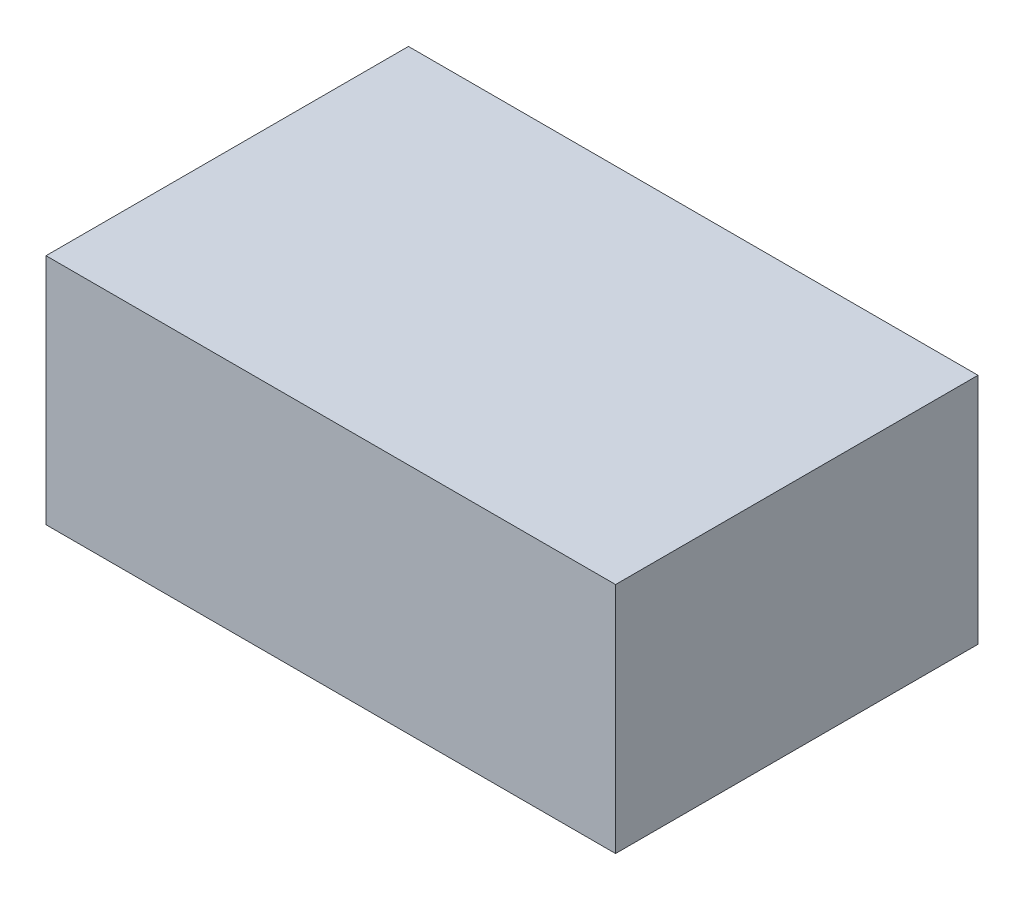
ISO-10303-21;
HEADER;
FILE_DESCRIPTION(('STEP AP214'),'2;1');
FILE_NAME('part.step','',(''),(''),'','','');
FILE_SCHEMA(('AUTOMOTIVE_DESIGN { 1 0 10303 214 1 1 1 1 }'));
ENDSEC;
DATA;
#1=APPLICATION_CONTEXT('core data for automotive mechanical design processes');
#2=APPLICATION_PROTOCOL_DEFINITION('international standard','automotive_design',2000,#1);
#3=PRODUCT_CONTEXT('',#1,'mechanical');
#4=PRODUCT('Part','Part','',(#3));
#5=PRODUCT_RELATED_PRODUCT_CATEGORY('part','',(#4));
#6=PRODUCT_DEFINITION_FORMATION('','',#4);
#7=PRODUCT_DEFINITION_CONTEXT('part definition',#1,'design');
#8=PRODUCT_DEFINITION('design','',#6,#7);
#9=PRODUCT_DEFINITION_SHAPE('','',#8);
#10=(LENGTH_UNIT() NAMED_UNIT(*) SI_UNIT(.MILLI.,.METRE.));
#11=(NAMED_UNIT(*) PLANE_ANGLE_UNIT() SI_UNIT($,.RADIAN.));
#12=(NAMED_UNIT(*) SI_UNIT($,.STERADIAN.) SOLID_ANGLE_UNIT());
#13=UNCERTAINTY_MEASURE_WITH_UNIT(LENGTH_MEASURE(1.E-05),#10,'distance_accuracy_value','');
#14=(GEOMETRIC_REPRESENTATION_CONTEXT(3) GLOBAL_UNCERTAINTY_ASSIGNED_CONTEXT((#13)) GLOBAL_UNIT_ASSIGNED_CONTEXT((#10,
#11,#12)) REPRESENTATION_CONTEXT('',''));
#15=CARTESIAN_POINT('',(0.,0.,0.));
#16=DIRECTION('',(0.,0.,1.));
#17=DIRECTION('',(1.,0.,0.));
#18=AXIS2_PLACEMENT_3D('',#15,#16,#17);
#19=CARTESIAN_POINT('',(34.925,28.575,22.225));
#20=DIRECTION('',(-1.,0.,0.));
#21=DIRECTION('',(0.,0.,1.));
#22=AXIS2_PLACEMENT_3D('',#19,#20,#21);
#23=PLANE('',#22);
#24=DIRECTION('',(0.,0.,-1.));
#25=VECTOR('',#24,1.);
#26=CARTESIAN_POINT('',(34.925,0.,22.225));
#27=LINE('',#26,#25);
#28=CARTESIAN_POINT('',(34.925,0.,22.225));
#29=VERTEX_POINT('',#28);
#30=CARTESIAN_POINT('',(34.925,0.,-22.225));
#31=VERTEX_POINT('',#30);
#32=EDGE_CURVE('E97',#29,#31,#27,.T.);
#33=ORIENTED_EDGE('',*,*,#32,.T.);
#34=DIRECTION('',(0.,-1.,0.));
#35=VECTOR('',#34,1.);
#36=CARTESIAN_POINT('',(34.925,28.575,-22.225));
#37=LINE('',#36,#35);
#38=CARTESIAN_POINT('',(34.925,28.575,-22.225));
#39=VERTEX_POINT('',#38);
#40=EDGE_CURVE('E11',#39,#31,#37,.T.);
#41=ORIENTED_EDGE('',*,*,#40,.F.);
#42=DIRECTION('',(0.,0.,-1.));
#43=VECTOR('',#42,1.);
#44=CARTESIAN_POINT('',(34.925,28.575,22.225));
#45=LINE('',#44,#43);
#46=CARTESIAN_POINT('',(34.925,28.575,22.225));
#47=VERTEX_POINT('',#46);
#48=EDGE_CURVE('E85',#47,#39,#45,.T.);
#49=ORIENTED_EDGE('',*,*,#48,.F.);
#50=DIRECTION('',(0.,-1.,0.));
#51=VECTOR('',#50,1.);
#52=CARTESIAN_POINT('',(34.925,28.575,22.225));
#53=LINE('',#52,#51);
#54=EDGE_CURVE('E93',#47,#29,#53,.T.);
#55=ORIENTED_EDGE('',*,*,#54,.T.);
#56=EDGE_LOOP('',(#33,#41,#49,#55));
#57=FACE_BOUND('',#56,.T.);
#58=ADVANCED_FACE('F34',(#57),#23,.F.);
#59=CARTESIAN_POINT('',(-34.925,28.575,-22.225));
#60=DIRECTION('',(0.,0.,1.));
#61=DIRECTION('',(1.,0.,0.));
#62=AXIS2_PLACEMENT_3D('',#59,#60,#61);
#63=PLANE('',#62);
#64=DIRECTION('',(-1.,0.,0.));
#65=VECTOR('',#64,1.);
#66=CARTESIAN_POINT('',(-34.925,0.,-22.225));
#67=LINE('',#66,#65);
#68=CARTESIAN_POINT('',(-34.925,0.,-22.225));
#69=VERTEX_POINT('',#68);
#70=EDGE_CURVE('E89',#31,#69,#67,.T.);
#71=ORIENTED_EDGE('',*,*,#70,.T.);
#72=DIRECTION('',(0.,-1.,0.));
#73=VECTOR('',#72,1.);
#74=CARTESIAN_POINT('',(-34.925,28.575,-22.225));
#75=LINE('',#74,#73);
#76=CARTESIAN_POINT('',(-34.925,28.575,-22.225));
#77=VERTEX_POINT('',#76);
#78=EDGE_CURVE('E42',#77,#69,#75,.T.);
#79=ORIENTED_EDGE('',*,*,#78,.F.);
#80=DIRECTION('',(-1.,0.,0.));
#81=VECTOR('',#80,1.);
#82=CARTESIAN_POINT('',(-34.925,28.575,-22.225));
#83=LINE('',#82,#81);
#84=EDGE_CURVE('E80',#39,#77,#83,.T.);
#85=ORIENTED_EDGE('',*,*,#84,.F.);
#86=ORIENTED_EDGE('',*,*,#40,.T.);
#87=EDGE_LOOP('',(#71,#79,#85,#86));
#88=FACE_BOUND('',#87,.T.);
#89=ADVANCED_FACE('F88',(#88),#63,.F.);
#90=CARTESIAN_POINT('',(-34.925,28.575,22.225));
#91=DIRECTION('',(1.,0.,0.));
#92=DIRECTION('',(0.,0.,-1.));
#93=AXIS2_PLACEMENT_3D('',#90,#91,#92);
#94=PLANE('',#93);
#95=DIRECTION('',(0.,0.,1.));
#96=VECTOR('',#95,1.);
#97=CARTESIAN_POINT('',(-34.925,0.,22.225));
#98=LINE('',#97,#96);
#99=CARTESIAN_POINT('',(-34.925,0.,22.225));
#100=VERTEX_POINT('',#99);
#101=EDGE_CURVE('E67',#69,#100,#98,.T.);
#102=ORIENTED_EDGE('',*,*,#101,.T.);
#103=DIRECTION('',(0.,-1.,0.));
#104=VECTOR('',#103,1.);
#105=CARTESIAN_POINT('',(-34.925,28.575,22.225));
#106=LINE('',#105,#104);
#107=CARTESIAN_POINT('',(-34.925,28.575,22.225));
#108=VERTEX_POINT('',#107);
#109=EDGE_CURVE('E90',#108,#100,#106,.T.);
#110=ORIENTED_EDGE('',*,*,#109,.F.);
#111=DIRECTION('',(0.,0.,1.));
#112=VECTOR('',#111,1.);
#113=CARTESIAN_POINT('',(-34.925,28.575,22.225));
#114=LINE('',#113,#112);
#115=EDGE_CURVE('E83',#77,#108,#114,.T.);
#116=ORIENTED_EDGE('',*,*,#115,.F.);
#117=ORIENTED_EDGE('',*,*,#78,.T.);
#118=EDGE_LOOP('',(#102,#110,#116,#117));
#119=FACE_BOUND('',#118,.T.);
#120=ADVANCED_FACE('F91',(#119),#94,.F.);
#121=CARTESIAN_POINT('',(-34.925,28.575,22.225));
#122=DIRECTION('',(0.,0.,-1.));
#123=DIRECTION('',(-1.,0.,0.));
#124=AXIS2_PLACEMENT_3D('',#121,#122,#123);
#125=PLANE('',#124);
#126=DIRECTION('',(1.,0.,0.));
#127=VECTOR('',#126,1.);
#128=CARTESIAN_POINT('',(-34.925,0.,22.225));
#129=LINE('',#128,#127);
#130=EDGE_CURVE('E73',#100,#29,#129,.T.);
#131=ORIENTED_EDGE('',*,*,#130,.T.);
#132=ORIENTED_EDGE('',*,*,#54,.F.);
#133=DIRECTION('',(1.,0.,0.));
#134=VECTOR('',#133,1.);
#135=CARTESIAN_POINT('',(-34.925,28.575,22.225));
#136=LINE('',#135,#134);
#137=EDGE_CURVE('E50',#108,#47,#136,.T.);
#138=ORIENTED_EDGE('',*,*,#137,.F.);
#139=ORIENTED_EDGE('',*,*,#109,.T.);
#140=EDGE_LOOP('',(#131,#132,#138,#139));
#141=FACE_BOUND('',#140,.T.);
#142=ADVANCED_FACE('F104',(#141),#125,.F.);
#143=CARTESIAN_POINT('',(0.,28.575,0.));
#144=DIRECTION('',(0.,-1.,0.));
#145=DIRECTION('',(0.,0.,-1.));
#146=AXIS2_PLACEMENT_3D('',#143,#144,#145);
#147=PLANE('',#146);
#148=ORIENTED_EDGE('',*,*,#48,.T.);
#149=ORIENTED_EDGE('',*,*,#84,.T.);
#150=ORIENTED_EDGE('',*,*,#115,.T.);
#151=ORIENTED_EDGE('',*,*,#137,.T.);
#152=EDGE_LOOP('',(#148,#149,#150,#151));
#153=FACE_BOUND('',#152,.T.);
#154=ADVANCED_FACE('F81',(#153),#147,.F.);
#155=CARTESIAN_POINT('',(0.,0.,0.));
#156=DIRECTION('',(0.,-1.,0.));
#157=DIRECTION('',(0.,0.,-1.));
#158=AXIS2_PLACEMENT_3D('',#155,#156,#157);
#159=PLANE('',#158);
#160=ORIENTED_EDGE('',*,*,#32,.F.);
#161=ORIENTED_EDGE('',*,*,#130,.F.);
#162=ORIENTED_EDGE('',*,*,#101,.F.);
#163=ORIENTED_EDGE('',*,*,#70,.F.);
#164=EDGE_LOOP('',(#160,#161,#162,#163));
#165=FACE_BOUND('',#164,.T.);
#166=ADVANCED_FACE('F107',(#165),#159,.T.);
#167=CLOSED_SHELL('',(#58,#89,#120,#142,#154,#166));
#168=MANIFOLD_SOLID_BREP('B2',#167);
#169=ADVANCED_BREP_SHAPE_REPRESENTATION('',(#18,#168),#14);
#170=SHAPE_DEFINITION_REPRESENTATION(#9,#169);
ENDSEC;
END-ISO-10303-21;
